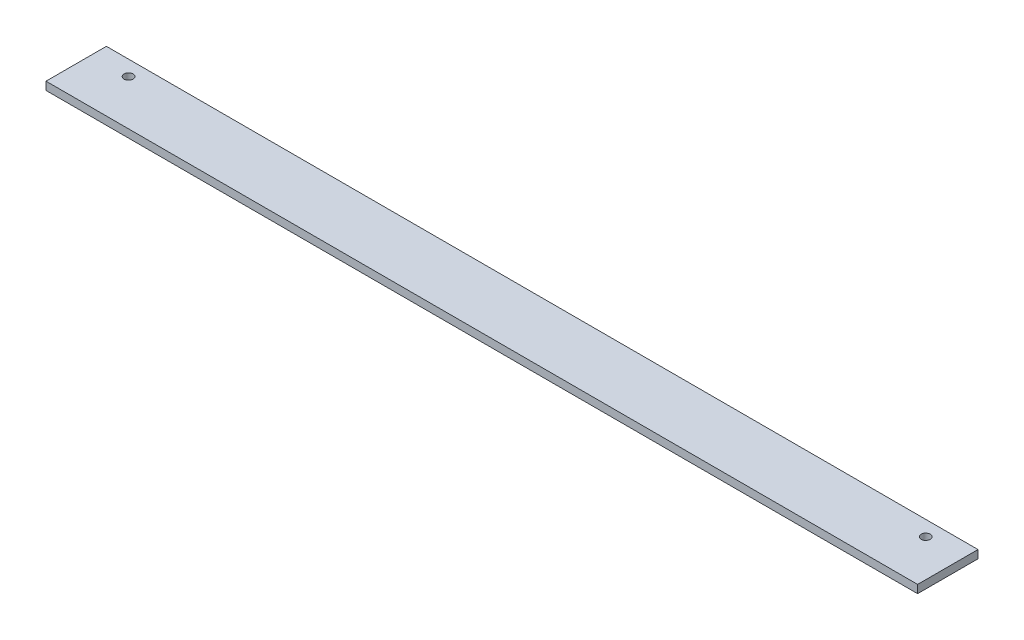
ISO-10303-21;
HEADER;
FILE_DESCRIPTION(('STEP AP214'),'2;1');
FILE_NAME('part.step','',(''),(''),'','','');
FILE_SCHEMA(('AUTOMOTIVE_DESIGN { 1 0 10303 214 1 1 1 1 }'));
ENDSEC;
DATA;
#1=APPLICATION_CONTEXT('core data for automotive mechanical design processes');
#2=APPLICATION_PROTOCOL_DEFINITION('international standard','automotive_design',2000,#1);
#3=PRODUCT_CONTEXT('',#1,'mechanical');
#4=PRODUCT('Part','Part','',(#3));
#5=PRODUCT_RELATED_PRODUCT_CATEGORY('part','',(#4));
#6=PRODUCT_DEFINITION_FORMATION('','',#4);
#7=PRODUCT_DEFINITION_CONTEXT('part definition',#1,'design');
#8=PRODUCT_DEFINITION('design','',#6,#7);
#9=PRODUCT_DEFINITION_SHAPE('','',#8);
#10=(LENGTH_UNIT() NAMED_UNIT(*) SI_UNIT(.MILLI.,.METRE.));
#11=(NAMED_UNIT(*) PLANE_ANGLE_UNIT() SI_UNIT($,.RADIAN.));
#12=(NAMED_UNIT(*) SI_UNIT($,.STERADIAN.) SOLID_ANGLE_UNIT());
#13=UNCERTAINTY_MEASURE_WITH_UNIT(LENGTH_MEASURE(1.E-05),#10,'distance_accuracy_value','');
#14=(GEOMETRIC_REPRESENTATION_CONTEXT(3) GLOBAL_UNCERTAINTY_ASSIGNED_CONTEXT((#13)) GLOBAL_UNIT_ASSIGNED_CONTEXT((#10,
#11,#12)) REPRESENTATION_CONTEXT('',''));
#15=CARTESIAN_POINT('',(0.,0.,0.));
#16=DIRECTION('',(0.,0.,1.));
#17=DIRECTION('',(1.,0.,0.));
#18=AXIS2_PLACEMENT_3D('',#15,#16,#17);
#19=CARTESIAN_POINT('',(433.,-2.,-15.));
#20=DIRECTION('',(0.,0.,1.));
#21=DIRECTION('',(1.,0.,0.));
#22=AXIS2_PLACEMENT_3D('',#19,#20,#21);
#23=PLANE('',#22);
#24=DIRECTION('',(0.,1.,0.));
#25=VECTOR('',#24,1.);
#26=CARTESIAN_POINT('',(0.,-2.,-15.));
#27=LINE('',#26,#25);
#28=CARTESIAN_POINT('',(0.,-2.,-15.));
#29=VERTEX_POINT('',#28);
#30=CARTESIAN_POINT('',(0.,2.,-15.));
#31=VERTEX_POINT('',#30);
#32=EDGE_CURVE('E98',#29,#31,#27,.T.);
#33=ORIENTED_EDGE('',*,*,#32,.T.);
#34=DIRECTION('',(-1.,0.,0.));
#35=VECTOR('',#34,1.);
#36=CARTESIAN_POINT('',(433.,2.,-15.));
#37=LINE('',#36,#35);
#38=CARTESIAN_POINT('',(433.,2.,-15.));
#39=VERTEX_POINT('',#38);
#40=EDGE_CURVE('E11',#39,#31,#37,.T.);
#41=ORIENTED_EDGE('',*,*,#40,.F.);
#42=DIRECTION('',(0.,1.,0.));
#43=VECTOR('',#42,1.);
#44=CARTESIAN_POINT('',(433.,-2.,-15.));
#45=LINE('',#44,#43);
#46=CARTESIAN_POINT('',(433.,-2.,-15.));
#47=VERTEX_POINT('',#46);
#48=EDGE_CURVE('E86',#47,#39,#45,.T.);
#49=ORIENTED_EDGE('',*,*,#48,.F.);
#50=DIRECTION('',(-1.,0.,0.));
#51=VECTOR('',#50,1.);
#52=CARTESIAN_POINT('',(433.,-2.,-15.));
#53=LINE('',#52,#51);
#54=EDGE_CURVE('E94',#47,#29,#53,.T.);
#55=ORIENTED_EDGE('',*,*,#54,.T.);
#56=EDGE_LOOP('',(#33,#41,#49,#55));
#57=FACE_BOUND('',#56,.T.);
#58=ADVANCED_FACE('F35',(#57),#23,.F.);
#59=CARTESIAN_POINT('',(433.,2.,15.));
#60=DIRECTION('',(0.,-1.,0.));
#61=DIRECTION('',(0.,0.,-1.));
#62=AXIS2_PLACEMENT_3D('',#59,#60,#61);
#63=PLANE('',#62);
#64=CARTESIAN_POINT('',(18.5,2.,-7.5));
#65=DIRECTION('',(0.,1.,0.));
#66=DIRECTION('',(0.,0.,1.));
#67=AXIS2_PLACEMENT_3D('',#64,#65,#66);
#68=CIRCLE('',#67,2.25);
#69=CARTESIAN_POINT('',(18.5,2.,-5.25));
#70=VERTEX_POINT('',#69);
#71=EDGE_CURVE('E118',#70,#70,#68,.T.);
#72=ORIENTED_EDGE('',*,*,#71,.F.);
#73=EDGE_LOOP('',(#72));
#74=FACE_BOUND('',#73,.T.);
#75=CARTESIAN_POINT('',(414.5,2.,-7.5));
#76=DIRECTION('',(0.,1.,0.));
#77=DIRECTION('',(0.,0.,1.));
#78=AXIS2_PLACEMENT_3D('',#75,#76,#77);
#79=CIRCLE('',#78,2.24999999999995);
#80=CARTESIAN_POINT('',(414.5,2.,-5.25000000000005));
#81=VERTEX_POINT('',#80);
#82=EDGE_CURVE('E112',#81,#81,#79,.T.);
#83=ORIENTED_EDGE('',*,*,#82,.F.);
#84=EDGE_LOOP('',(#83));
#85=FACE_BOUND('',#84,.T.);
#86=DIRECTION('',(0.,0.,1.));
#87=VECTOR('',#86,1.);
#88=CARTESIAN_POINT('',(0.,2.,15.));
#89=LINE('',#88,#87);
#90=CARTESIAN_POINT('',(0.,2.,15.));
#91=VERTEX_POINT('',#90);
#92=EDGE_CURVE('E90',#31,#91,#89,.T.);
#93=ORIENTED_EDGE('',*,*,#92,.T.);
#94=DIRECTION('',(-1.,0.,0.));
#95=VECTOR('',#94,1.);
#96=CARTESIAN_POINT('',(433.,2.,15.));
#97=LINE('',#96,#95);
#98=CARTESIAN_POINT('',(433.,2.,15.));
#99=VERTEX_POINT('',#98);
#100=EDGE_CURVE('E43',#99,#91,#97,.T.);
#101=ORIENTED_EDGE('',*,*,#100,.F.);
#102=DIRECTION('',(0.,0.,1.));
#103=VECTOR('',#102,1.);
#104=CARTESIAN_POINT('',(433.,2.,15.));
#105=LINE('',#104,#103);
#106=EDGE_CURVE('E81',#39,#99,#105,.T.);
#107=ORIENTED_EDGE('',*,*,#106,.F.);
#108=ORIENTED_EDGE('',*,*,#40,.T.);
#109=EDGE_LOOP('',(#93,#101,#107,#108));
#110=FACE_BOUND('',#109,.T.);
#111=ADVANCED_FACE('F89',(#74,#85,#110),#63,.F.);
#112=CARTESIAN_POINT('',(433.,-2.,15.));
#113=DIRECTION('',(0.,0.,-1.));
#114=DIRECTION('',(-1.,0.,0.));
#115=AXIS2_PLACEMENT_3D('',#112,#113,#114);
#116=PLANE('',#115);
#117=DIRECTION('',(0.,-1.,0.));
#118=VECTOR('',#117,1.);
#119=CARTESIAN_POINT('',(0.,-2.,15.));
#120=LINE('',#119,#118);
#121=CARTESIAN_POINT('',(0.,-2.,15.));
#122=VERTEX_POINT('',#121);
#123=EDGE_CURVE('E68',#91,#122,#120,.T.);
#124=ORIENTED_EDGE('',*,*,#123,.T.);
#125=DIRECTION('',(-1.,0.,0.));
#126=VECTOR('',#125,1.);
#127=CARTESIAN_POINT('',(433.,-2.,15.));
#128=LINE('',#127,#126);
#129=CARTESIAN_POINT('',(433.,-2.,15.));
#130=VERTEX_POINT('',#129);
#131=EDGE_CURVE('E91',#130,#122,#128,.T.);
#132=ORIENTED_EDGE('',*,*,#131,.F.);
#133=DIRECTION('',(0.,-1.,0.));
#134=VECTOR('',#133,1.);
#135=CARTESIAN_POINT('',(433.,-2.,15.));
#136=LINE('',#135,#134);
#137=EDGE_CURVE('E84',#99,#130,#136,.T.);
#138=ORIENTED_EDGE('',*,*,#137,.F.);
#139=ORIENTED_EDGE('',*,*,#100,.T.);
#140=EDGE_LOOP('',(#124,#132,#138,#139));
#141=FACE_BOUND('',#140,.T.);
#142=ADVANCED_FACE('F92',(#141),#116,.F.);
#143=CARTESIAN_POINT('',(433.,-2.,15.));
#144=DIRECTION('',(0.,1.,0.));
#145=DIRECTION('',(0.,0.,1.));
#146=AXIS2_PLACEMENT_3D('',#143,#144,#145);
#147=PLANE('',#146);
#148=CARTESIAN_POINT('',(18.5,-2.,-7.5));
#149=DIRECTION('',(0.,1.,0.));
#150=DIRECTION('',(0.,0.,1.));
#151=AXIS2_PLACEMENT_3D('',#148,#149,#150);
#152=CIRCLE('',#151,2.25);
#153=CARTESIAN_POINT('',(18.5,-2.,-5.25));
#154=VERTEX_POINT('',#153);
#155=EDGE_CURVE('E101',#154,#154,#152,.T.);
#156=ORIENTED_EDGE('',*,*,#155,.T.);
#157=EDGE_LOOP('',(#156));
#158=FACE_BOUND('',#157,.T.);
#159=CARTESIAN_POINT('',(414.5,-2.,-7.5));
#160=DIRECTION('',(0.,1.,0.));
#161=DIRECTION('',(0.,0.,1.));
#162=AXIS2_PLACEMENT_3D('',#159,#160,#161);
#163=CIRCLE('',#162,2.24999999999995);
#164=CARTESIAN_POINT('',(414.5,-2.,-5.25000000000005));
#165=VERTEX_POINT('',#164);
#166=EDGE_CURVE('E115',#165,#165,#163,.T.);
#167=ORIENTED_EDGE('',*,*,#166,.T.);
#168=EDGE_LOOP('',(#167));
#169=FACE_BOUND('',#168,.T.);
#170=DIRECTION('',(0.,0.,-1.));
#171=VECTOR('',#170,1.);
#172=CARTESIAN_POINT('',(0.,-2.,15.));
#173=LINE('',#172,#171);
#174=EDGE_CURVE('E74',#122,#29,#173,.T.);
#175=ORIENTED_EDGE('',*,*,#174,.T.);
#176=ORIENTED_EDGE('',*,*,#54,.F.);
#177=DIRECTION('',(0.,0.,-1.));
#178=VECTOR('',#177,1.);
#179=CARTESIAN_POINT('',(433.,-2.,15.));
#180=LINE('',#179,#178);
#181=EDGE_CURVE('E51',#130,#47,#180,.T.);
#182=ORIENTED_EDGE('',*,*,#181,.F.);
#183=ORIENTED_EDGE('',*,*,#131,.T.);
#184=EDGE_LOOP('',(#175,#176,#182,#183));
#185=FACE_BOUND('',#184,.T.);
#186=ADVANCED_FACE('F106',(#158,#169,#185),#147,.F.);
#187=CARTESIAN_POINT('',(433.,0.,0.));
#188=DIRECTION('',(-1.,0.,0.));
#189=DIRECTION('',(0.,0.,1.));
#190=AXIS2_PLACEMENT_3D('',#187,#188,#189);
#191=PLANE('',#190);
#192=ORIENTED_EDGE('',*,*,#48,.T.);
#193=ORIENTED_EDGE('',*,*,#106,.T.);
#194=ORIENTED_EDGE('',*,*,#137,.T.);
#195=ORIENTED_EDGE('',*,*,#181,.T.);
#196=EDGE_LOOP('',(#192,#193,#194,#195));
#197=FACE_BOUND('',#196,.T.);
#198=ADVANCED_FACE('F82',(#197),#191,.F.);
#199=CARTESIAN_POINT('',(0.,0.,0.));
#200=DIRECTION('',(-1.,0.,0.));
#201=DIRECTION('',(0.,0.,1.));
#202=AXIS2_PLACEMENT_3D('',#199,#200,#201);
#203=PLANE('',#202);
#204=ORIENTED_EDGE('',*,*,#32,.F.);
#205=ORIENTED_EDGE('',*,*,#174,.F.);
#206=ORIENTED_EDGE('',*,*,#123,.F.);
#207=ORIENTED_EDGE('',*,*,#92,.F.);
#208=EDGE_LOOP('',(#204,#205,#206,#207));
#209=FACE_BOUND('',#208,.T.);
#210=ADVANCED_FACE('F109',(#209),#203,.T.);
#211=CARTESIAN_POINT('',(414.5,-2.,-7.5));
#212=DIRECTION('',(0.,1.,0.));
#213=DIRECTION('',(0.,0.,1.));
#214=AXIS2_PLACEMENT_3D('',#211,#212,#213);
#215=CYLINDRICAL_SURFACE('',#214,2.24999999999995);
#216=ORIENTED_EDGE('',*,*,#166,.F.);
#217=EDGE_LOOP('',(#216));
#218=FACE_BOUND('',#217,.T.);
#219=ORIENTED_EDGE('',*,*,#82,.T.);
#220=EDGE_LOOP('',(#219));
#221=FACE_BOUND('',#220,.T.);
#222=ADVANCED_FACE('F129',(#218,#221),#215,.F.);
#223=CARTESIAN_POINT('',(18.5,-2.,-7.5));
#224=DIRECTION('',(0.,1.,0.));
#225=DIRECTION('',(0.,0.,1.));
#226=AXIS2_PLACEMENT_3D('',#223,#224,#225);
#227=CYLINDRICAL_SURFACE('',#226,2.25);
#228=ORIENTED_EDGE('',*,*,#155,.F.);
#229=EDGE_LOOP('',(#228));
#230=FACE_BOUND('',#229,.T.);
#231=ORIENTED_EDGE('',*,*,#71,.T.);
#232=EDGE_LOOP('',(#231));
#233=FACE_BOUND('',#232,.T.);
#234=ADVANCED_FACE('F126',(#230,#233),#227,.F.);
#235=CLOSED_SHELL('',(#58,#111,#142,#186,#198,#210,#222,#234));
#236=MANIFOLD_SOLID_BREP('B2',#235);
#237=ADVANCED_BREP_SHAPE_REPRESENTATION('',(#18,#236),#14);
#238=SHAPE_DEFINITION_REPRESENTATION(#9,#237);
ENDSEC;
END-ISO-10303-21;
